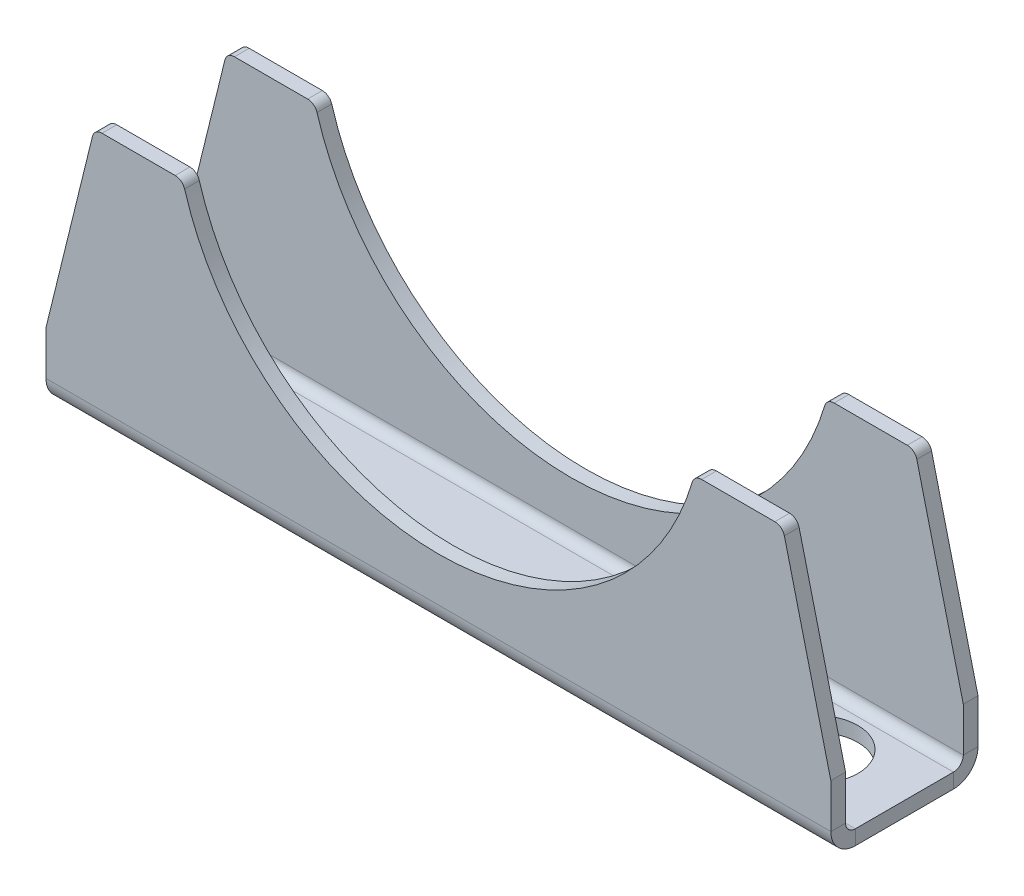
ISO-10303-21;
HEADER;
FILE_DESCRIPTION(('STEP AP214'),'2;1');
FILE_NAME('part.step','',(''),(''),'','','');
FILE_SCHEMA(('AUTOMOTIVE_DESIGN { 1 0 10303 214 1 1 1 1 }'));
ENDSEC;
DATA;
#1=APPLICATION_CONTEXT('core data for automotive mechanical design processes');
#2=APPLICATION_PROTOCOL_DEFINITION('international standard','automotive_design',2000,#1);
#3=PRODUCT_CONTEXT('',#1,'mechanical');
#4=PRODUCT('Part','Part','',(#3));
#5=PRODUCT_RELATED_PRODUCT_CATEGORY('part','',(#4));
#6=PRODUCT_DEFINITION_FORMATION('','',#4);
#7=PRODUCT_DEFINITION_CONTEXT('part definition',#1,'design');
#8=PRODUCT_DEFINITION('design','',#6,#7);
#9=PRODUCT_DEFINITION_SHAPE('','',#8);
#10=(LENGTH_UNIT() NAMED_UNIT(*) SI_UNIT(.MILLI.,.METRE.));
#11=(NAMED_UNIT(*) PLANE_ANGLE_UNIT() SI_UNIT($,.RADIAN.));
#12=(NAMED_UNIT(*) SI_UNIT($,.STERADIAN.) SOLID_ANGLE_UNIT());
#13=UNCERTAINTY_MEASURE_WITH_UNIT(LENGTH_MEASURE(1.E-05),#10,'distance_accuracy_value','');
#14=(GEOMETRIC_REPRESENTATION_CONTEXT(3) GLOBAL_UNCERTAINTY_ASSIGNED_CONTEXT((#13)) GLOBAL_UNIT_ASSIGNED_CONTEXT((#10,
#11,#12)) REPRESENTATION_CONTEXT('',''));
#15=CARTESIAN_POINT('',(0.,0.,0.));
#16=DIRECTION('',(0.,0.,1.));
#17=DIRECTION('',(1.,0.,0.));
#18=AXIS2_PLACEMENT_3D('',#15,#16,#17);
#19=CARTESIAN_POINT('',(80.,-1.5,-4.99999999999998));
#20=DIRECTION('',(1.,0.,0.));
#21=DIRECTION('',(0.,0.,-1.));
#22=AXIS2_PLACEMENT_3D('',#19,#20,#21);
#23=PLANE('',#22);
#24=DIRECTION('',(0.,1.,0.));
#25=VECTOR('',#24,1.);
#26=CARTESIAN_POINT('',(80.,1.00000000000001,-7.5));
#27=LINE('',#26,#25);
#28=CARTESIAN_POINT('',(80.,1.,-7.5));
#29=VERTEX_POINT('',#28);
#30=CARTESIAN_POINT('',(80.,5.49999999999998,-7.5));
#31=VERTEX_POINT('',#30);
#32=EDGE_CURVE('E281',#29,#31,#27,.T.);
#33=ORIENTED_EDGE('',*,*,#32,.T.);
#34=DIRECTION('',(0.,0.,1.));
#35=VECTOR('',#34,1.);
#36=CARTESIAN_POINT('',(80.,5.49999999999998,-27.5));
#37=LINE('',#36,#35);
#38=CARTESIAN_POINT('',(80.,5.49999999999998,-6.));
#39=VERTEX_POINT('',#38);
#40=EDGE_CURVE('E416',#31,#39,#37,.T.);
#41=ORIENTED_EDGE('',*,*,#40,.T.);
#42=DIRECTION('',(0.,1.,0.));
#43=VECTOR('',#42,1.);
#44=CARTESIAN_POINT('',(80.,1.00000000000001,-6.));
#45=LINE('',#44,#43);
#46=CARTESIAN_POINT('',(80.,1.,-6.));
#47=VERTEX_POINT('',#46);
#48=EDGE_CURVE('E449',#47,#39,#45,.T.);
#49=ORIENTED_EDGE('',*,*,#48,.F.);
#50=DIRECTION('',(0.,0.,-1.));
#51=VECTOR('',#50,1.);
#52=CARTESIAN_POINT('',(80.,1.,-6.));
#53=LINE('',#52,#51);
#54=EDGE_CURVE('E326',#47,#29,#53,.T.);
#55=ORIENTED_EDGE('',*,*,#54,.T.);
#56=EDGE_LOOP('',(#33,#41,#49,#55));
#57=FACE_BOUND('',#56,.T.);
#58=ADVANCED_FACE('F40',(#57),#23,.T.);
#59=CARTESIAN_POINT('',(80.,1.00000000000001,-7.5));
#60=DIRECTION('',(0.,0.,1.));
#61=DIRECTION('',(1.,0.,0.));
#62=AXIS2_PLACEMENT_3D('',#59,#60,#61);
#63=PLANE('',#62);
#64=DIRECTION('',(-1.,0.,0.));
#65=VECTOR('',#64,1.);
#66=CARTESIAN_POINT('',(80.,25.5,-7.5));
#67=LINE('',#66,#65);
#68=CARTESIAN_POINT('',(74.2931174471588,25.5,-7.5));
#69=VERTEX_POINT('',#68);
#70=CARTESIAN_POINT('',(66.8328157299975,25.5,-7.5));
#71=VERTEX_POINT('',#70);
#72=EDGE_CURVE('E320',#69,#71,#67,.T.);
#73=ORIENTED_EDGE('',*,*,#72,.F.);
#74=CARTESIAN_POINT('',(74.2931174471588,24.5,-7.5));
#75=DIRECTION('',(0.,0.,1.));
#76=DIRECTION('',(1.,0.,0.));
#77=AXIS2_PLACEMENT_3D('',#74,#75,#76);
#78=CIRCLE('',#77,1.);
#79=CARTESIAN_POINT('',(75.2641310476359,24.7390242407966,-7.5));
#80=VERTEX_POINT('',#79);
#81=EDGE_CURVE('E360',#69,#80,#78,.F.);
#82=ORIENTED_EDGE('',*,*,#81,.T.);
#83=DIRECTION('',(-0.239024240796562,0.971013600477165,0.));
#84=VECTOR('',#83,1.);
#85=CARTESIAN_POINT('',(81.0444310489573,1.25709664459768,-7.5));
#86=LINE('',#85,#84);
#87=EDGE_CURVE('E436',#31,#80,#86,.T.);
#88=ORIENTED_EDGE('',*,*,#87,.F.);
#89=ORIENTED_EDGE('',*,*,#32,.F.);
#90=DIRECTION('',(-1.,0.,0.));
#91=VECTOR('',#90,1.);
#92=CARTESIAN_POINT('',(80.,1.,-7.5));
#93=LINE('',#92,#91);
#94=CARTESIAN_POINT('',(0.,1.,-7.5));
#95=VERTEX_POINT('',#94);
#96=EDGE_CURVE('E282',#29,#95,#93,.T.);
#97=ORIENTED_EDGE('',*,*,#96,.T.);
#98=DIRECTION('',(0.,1.,0.));
#99=VECTOR('',#98,1.);
#100=CARTESIAN_POINT('',(0.,1.00000000000001,-7.5));
#101=LINE('',#100,#99);
#102=CARTESIAN_POINT('',(0.,5.5,-7.5));
#103=VERTEX_POINT('',#102);
#104=EDGE_CURVE('E255',#95,#103,#101,.T.);
#105=ORIENTED_EDGE('',*,*,#104,.T.);
#106=DIRECTION('',(0.239024240796562,0.971013600477165,0.));
#107=VECTOR('',#106,1.);
#108=CARTESIAN_POINT('',(3.5261759661125,19.8247597371729,-7.5));
#109=LINE('',#108,#107);
#110=CARTESIAN_POINT('',(4.73586895236409,24.7390242407966,-7.5));
#111=VERTEX_POINT('',#110);
#112=EDGE_CURVE('E232',#103,#111,#109,.T.);
#113=ORIENTED_EDGE('',*,*,#112,.T.);
#114=CARTESIAN_POINT('',(5.70688255284123,24.5,-7.5));
#115=DIRECTION('',(0.,0.,1.));
#116=DIRECTION('',(1.,0.,0.));
#117=AXIS2_PLACEMENT_3D('',#114,#115,#116);
#118=CIRCLE('',#117,1.);
#119=CARTESIAN_POINT('',(5.70688255284123,25.5,-7.5));
#120=VERTEX_POINT('',#119);
#121=EDGE_CURVE('E354',#111,#120,#118,.F.);
#122=ORIENTED_EDGE('',*,*,#121,.T.);
#123=CARTESIAN_POINT('',(13.1671842700025,25.5,-7.5));
#124=VERTEX_POINT('',#123);
#125=EDGE_CURVE('E317',#124,#120,#67,.T.);
#126=ORIENTED_EDGE('',*,*,#125,.F.);
#127=CARTESIAN_POINT('',(13.1671842700025,24.5,-7.5));
#128=DIRECTION('',(0.,0.,1.));
#129=DIRECTION('',(1.,0.,0.));
#130=AXIS2_PLACEMENT_3D('',#127,#128,#129);
#131=CIRCLE('',#130,1.);
#132=CARTESIAN_POINT('',(14.1254991175024,24.7857142857143,-7.5));
#133=VERTEX_POINT('',#132);
#134=EDGE_CURVE('E356',#124,#133,#131,.F.);
#135=ORIENTED_EDGE('',*,*,#134,.T.);
#136=CARTESIAN_POINT('',(40.,32.5,-7.5));
#137=DIRECTION('',(0.,0.,1.));
#138=DIRECTION('',(1.,0.,0.));
#139=AXIS2_PLACEMENT_3D('',#136,#137,#138);
#140=CIRCLE('',#139,27.);
#141=CARTESIAN_POINT('',(65.8745008824976,24.7857142857143,-7.5));
#142=VERTEX_POINT('',#141);
#143=EDGE_CURVE('E259',#133,#142,#140,.T.);
#144=ORIENTED_EDGE('',*,*,#143,.T.);
#145=CARTESIAN_POINT('',(66.8328157299975,24.5,-7.5));
#146=DIRECTION('',(0.,0.,1.));
#147=DIRECTION('',(1.,0.,0.));
#148=AXIS2_PLACEMENT_3D('',#145,#146,#147);
#149=CIRCLE('',#148,1.);
#150=EDGE_CURVE('E358',#142,#71,#149,.F.);
#151=ORIENTED_EDGE('',*,*,#150,.T.);
#152=EDGE_LOOP('',(#73,#82,#88,#89,#97,#105,#113,#122,#126,#135,#144,#151));
#153=FACE_BOUND('',#152,.T.);
#154=ADVANCED_FACE('F483',(#153),#63,.F.);
#155=CARTESIAN_POINT('',(80.,25.5,-6.));
#156=DIRECTION('',(0.,1.,0.));
#157=DIRECTION('',(0.,0.,1.));
#158=AXIS2_PLACEMENT_3D('',#155,#156,#157);
#159=PLANE('',#158);
#160=DIRECTION('',(-1.,0.,0.));
#161=VECTOR('',#160,1.);
#162=CARTESIAN_POINT('',(80.,25.5,-6.));
#163=LINE('',#162,#161);
#164=CARTESIAN_POINT('',(74.2931174471588,25.5,-6.));
#165=VERTEX_POINT('',#164);
#166=CARTESIAN_POINT('',(66.8328157299975,25.5,-6.));
#167=VERTEX_POINT('',#166);
#168=EDGE_CURVE('E316',#165,#167,#163,.T.);
#169=ORIENTED_EDGE('',*,*,#168,.F.);
#170=DIRECTION('',(0.,0.,1.));
#171=VECTOR('',#170,1.);
#172=CARTESIAN_POINT('',(74.2931174471588,25.5,-6.));
#173=LINE('',#172,#171);
#174=EDGE_CURVE('E352',#165,#69,#173,.F.);
#175=ORIENTED_EDGE('',*,*,#174,.T.);
#176=ORIENTED_EDGE('',*,*,#72,.T.);
#177=DIRECTION('',(0.,0.,-1.));
#178=VECTOR('',#177,1.);
#179=CARTESIAN_POINT('',(66.8328157299975,25.5,-6.));
#180=LINE('',#179,#178);
#181=EDGE_CURVE('E349',#71,#167,#180,.F.);
#182=ORIENTED_EDGE('',*,*,#181,.T.);
#183=EDGE_LOOP('',(#169,#175,#176,#182));
#184=FACE_BOUND('',#183,.T.);
#185=ADVANCED_FACE('F553',(#184),#159,.T.);
#186=CARTESIAN_POINT('',(13.1671842700025,25.5,-6.));
#187=VERTEX_POINT('',#186);
#188=CARTESIAN_POINT('',(5.70688255284123,25.5,-6.));
#189=VERTEX_POINT('',#188);
#190=EDGE_CURVE('E314',#187,#189,#163,.T.);
#191=ORIENTED_EDGE('',*,*,#190,.F.);
#192=DIRECTION('',(0.,0.,-1.));
#193=VECTOR('',#192,1.);
#194=CARTESIAN_POINT('',(13.1671842700025,25.5,-7.5));
#195=LINE('',#194,#193);
#196=EDGE_CURVE('E402',#187,#124,#195,.T.);
#197=ORIENTED_EDGE('',*,*,#196,.T.);
#198=ORIENTED_EDGE('',*,*,#125,.T.);
#199=DIRECTION('',(0.,0.,1.));
#200=VECTOR('',#199,1.);
#201=CARTESIAN_POINT('',(5.70688255284123,25.5,-6.));
#202=LINE('',#201,#200);
#203=EDGE_CURVE('E399',#120,#189,#202,.T.);
#204=ORIENTED_EDGE('',*,*,#203,.T.);
#205=EDGE_LOOP('',(#191,#197,#198,#204));
#206=FACE_BOUND('',#205,.T.);
#207=ADVANCED_FACE('F570',(#206),#159,.T.);
#208=CARTESIAN_POINT('',(80.,1.00000000000001,-6.));
#209=DIRECTION('',(0.,0.,1.));
#210=DIRECTION('',(1.,0.,0.));
#211=AXIS2_PLACEMENT_3D('',#208,#209,#210);
#212=PLANE('',#211);
#213=DIRECTION('',(-0.239024240796562,0.971013600477165,0.));
#214=VECTOR('',#213,1.);
#215=CARTESIAN_POINT('',(81.0444310489573,1.25709664459768,-6.));
#216=LINE('',#215,#214);
#217=CARTESIAN_POINT('',(75.2641310476359,24.7390242407966,-6.));
#218=VERTEX_POINT('',#217);
#219=EDGE_CURVE('E441',#39,#218,#216,.T.);
#220=ORIENTED_EDGE('',*,*,#219,.T.);
#221=CARTESIAN_POINT('',(74.2931174471588,24.5,-6.));
#222=DIRECTION('',(0.,0.,1.));
#223=DIRECTION('',(1.,0.,0.));
#224=AXIS2_PLACEMENT_3D('',#221,#222,#223);
#225=CIRCLE('',#224,1.);
#226=EDGE_CURVE('E347',#218,#165,#225,.T.);
#227=ORIENTED_EDGE('',*,*,#226,.T.);
#228=ORIENTED_EDGE('',*,*,#168,.T.);
#229=CARTESIAN_POINT('',(66.8328157299975,24.5,-6.));
#230=DIRECTION('',(0.,0.,1.));
#231=DIRECTION('',(1.,0.,0.));
#232=AXIS2_PLACEMENT_3D('',#229,#230,#231);
#233=CIRCLE('',#232,1.);
#234=CARTESIAN_POINT('',(65.8745008824976,24.7857142857143,-6.));
#235=VERTEX_POINT('',#234);
#236=EDGE_CURVE('E345',#167,#235,#233,.T.);
#237=ORIENTED_EDGE('',*,*,#236,.T.);
#238=CARTESIAN_POINT('',(40.,32.5,-6.));
#239=DIRECTION('',(0.,0.,1.));
#240=DIRECTION('',(1.,0.,0.));
#241=AXIS2_PLACEMENT_3D('',#238,#239,#240);
#242=CIRCLE('',#241,27.);
#243=CARTESIAN_POINT('',(14.1254991175024,24.7857142857143,-6.));
#244=VERTEX_POINT('',#243);
#245=EDGE_CURVE('E435',#244,#235,#242,.T.);
#246=ORIENTED_EDGE('',*,*,#245,.F.);
#247=CARTESIAN_POINT('',(13.1671842700025,24.5,-6.));
#248=DIRECTION('',(0.,0.,1.));
#249=DIRECTION('',(1.,0.,0.));
#250=AXIS2_PLACEMENT_3D('',#247,#248,#249);
#251=CIRCLE('',#250,1.);
#252=EDGE_CURVE('E343',#244,#187,#251,.T.);
#253=ORIENTED_EDGE('',*,*,#252,.T.);
#254=ORIENTED_EDGE('',*,*,#190,.T.);
#255=CARTESIAN_POINT('',(5.70688255284123,24.5,-6.));
#256=DIRECTION('',(0.,0.,1.));
#257=DIRECTION('',(1.,0.,0.));
#258=AXIS2_PLACEMENT_3D('',#255,#256,#257);
#259=CIRCLE('',#258,1.);
#260=CARTESIAN_POINT('',(4.73586895236409,24.7390242407966,-6.));
#261=VERTEX_POINT('',#260);
#262=EDGE_CURVE('E248',#189,#261,#259,.T.);
#263=ORIENTED_EDGE('',*,*,#262,.T.);
#264=DIRECTION('',(0.239024240796562,0.971013600477165,0.));
#265=VECTOR('',#264,1.);
#266=CARTESIAN_POINT('',(3.5261759661125,19.8247597371729,-6.));
#267=LINE('',#266,#265);
#268=CARTESIAN_POINT('',(0.,5.5,-6.));
#269=VERTEX_POINT('',#268);
#270=EDGE_CURVE('E229',#269,#261,#267,.T.);
#271=ORIENTED_EDGE('',*,*,#270,.F.);
#272=DIRECTION('',(0.,1.,0.));
#273=VECTOR('',#272,1.);
#274=CARTESIAN_POINT('',(0.,1.00000000000001,-6.));
#275=LINE('',#274,#273);
#276=CARTESIAN_POINT('',(0.,1.,-6.));
#277=VERTEX_POINT('',#276);
#278=EDGE_CURVE('E245',#277,#269,#275,.T.);
#279=ORIENTED_EDGE('',*,*,#278,.F.);
#280=DIRECTION('',(-1.,0.,0.));
#281=VECTOR('',#280,1.);
#282=CARTESIAN_POINT('',(80.,1.,-6.));
#283=LINE('',#282,#281);
#284=EDGE_CURVE('E312',#47,#277,#283,.T.);
#285=ORIENTED_EDGE('',*,*,#284,.F.);
#286=ORIENTED_EDGE('',*,*,#48,.T.);
#287=EDGE_LOOP('',(#220,#227,#228,#237,#246,#253,#254,#263,#271,#279,#285,#286));
#288=FACE_BOUND('',#287,.T.);
#289=ADVANCED_FACE('F243',(#288),#212,.T.);
#290=CARTESIAN_POINT('',(80.,25.5,6.));
#291=DIRECTION('',(0.,0.,-1.));
#292=DIRECTION('',(0.,1.,0.));
#293=AXIS2_PLACEMENT_3D('',#290,#291,#292);
#294=PLANE('',#293);
#295=DIRECTION('',(-1.,0.,0.));
#296=VECTOR('',#295,1.);
#297=CARTESIAN_POINT('',(80.,25.5,6.));
#298=LINE('',#297,#296);
#299=CARTESIAN_POINT('',(74.2931174471588,25.5,6.));
#300=VERTEX_POINT('',#299);
#301=CARTESIAN_POINT('',(66.8328157299975,25.5,6.));
#302=VERTEX_POINT('',#301);
#303=EDGE_CURVE('E302',#300,#302,#298,.T.);
#304=ORIENTED_EDGE('',*,*,#303,.F.);
#305=CARTESIAN_POINT('',(74.2931174471588,24.5,6.00000000000001));
#306=DIRECTION('',(0.,0.,-1.));
#307=DIRECTION('',(0.,1.,0.));
#308=AXIS2_PLACEMENT_3D('',#305,#306,#307);
#309=CIRCLE('',#308,1.);
#310=CARTESIAN_POINT('',(75.2641310476359,24.7390242407966,6.));
#311=VERTEX_POINT('',#310);
#312=EDGE_CURVE('E383',#300,#311,#309,.T.);
#313=ORIENTED_EDGE('',*,*,#312,.T.);
#314=DIRECTION('',(0.239024240796562,-0.971013600477165,0.));
#315=VECTOR('',#314,1.);
#316=CARTESIAN_POINT('',(75.3580842268562,24.3573482462325,6.));
#317=LINE('',#316,#315);
#318=CARTESIAN_POINT('',(80.,5.49999999999998,6.));
#319=VERTEX_POINT('',#318);
#320=EDGE_CURVE('E528',#311,#319,#317,.T.);
#321=ORIENTED_EDGE('',*,*,#320,.T.);
#322=DIRECTION('',(0.,-1.,0.));
#323=VECTOR('',#322,1.);
#324=CARTESIAN_POINT('',(80.,25.5,6.));
#325=LINE('',#324,#323);
#326=CARTESIAN_POINT('',(80.,1.00000000000001,6.));
#327=VERTEX_POINT('',#326);
#328=EDGE_CURVE('E461',#319,#327,#325,.T.);
#329=ORIENTED_EDGE('',*,*,#328,.T.);
#330=DIRECTION('',(-1.,0.,0.));
#331=VECTOR('',#330,1.);
#332=CARTESIAN_POINT('',(80.,1.00000000000001,6.));
#333=LINE('',#332,#331);
#334=CARTESIAN_POINT('',(0.,1.00000000000001,6.));
#335=VERTEX_POINT('',#334);
#336=EDGE_CURVE('E303',#327,#335,#333,.T.);
#337=ORIENTED_EDGE('',*,*,#336,.T.);
#338=DIRECTION('',(0.,-1.,0.));
#339=VECTOR('',#338,1.);
#340=CARTESIAN_POINT('',(0.,25.5,6.));
#341=LINE('',#340,#339);
#342=CARTESIAN_POINT('',(0.,5.5,6.00000000000001));
#343=VERTEX_POINT('',#342);
#344=EDGE_CURVE('E268',#343,#335,#341,.T.);
#345=ORIENTED_EDGE('',*,*,#344,.F.);
#346=DIRECTION('',(-0.239024240796562,-0.971013600477165,0.));
#347=VECTOR('',#346,1.);
#348=CARTESIAN_POINT('',(9.21252278821366,42.9250113388078,6.00000000000001));
#349=LINE('',#348,#347);
#350=CARTESIAN_POINT('',(4.73586895236408,24.7390242407966,6.));
#351=VERTEX_POINT('',#350);
#352=EDGE_CURVE('E249',#351,#343,#349,.T.);
#353=ORIENTED_EDGE('',*,*,#352,.F.);
#354=CARTESIAN_POINT('',(5.70688255284123,24.5,6.));
#355=DIRECTION('',(0.,0.,-1.));
#356=DIRECTION('',(0.,1.,0.));
#357=AXIS2_PLACEMENT_3D('',#354,#355,#356);
#358=CIRCLE('',#357,1.);
#359=CARTESIAN_POINT('',(5.70688255284123,25.5,6.));
#360=VERTEX_POINT('',#359);
#361=EDGE_CURVE('E378',#351,#360,#358,.T.);
#362=ORIENTED_EDGE('',*,*,#361,.T.);
#363=CARTESIAN_POINT('',(13.1671842700025,25.5,6.));
#364=VERTEX_POINT('',#363);
#365=EDGE_CURVE('E299',#364,#360,#298,.T.);
#366=ORIENTED_EDGE('',*,*,#365,.F.);
#367=CARTESIAN_POINT('',(13.1671842700025,24.5,6.00000000000001));
#368=DIRECTION('',(0.,0.,-1.));
#369=DIRECTION('',(0.,1.,0.));
#370=AXIS2_PLACEMENT_3D('',#367,#368,#369);
#371=CIRCLE('',#370,1.);
#372=CARTESIAN_POINT('',(14.1254991175024,24.7857142857143,6.));
#373=VERTEX_POINT('',#372);
#374=EDGE_CURVE('E55',#364,#373,#371,.T.);
#375=ORIENTED_EDGE('',*,*,#374,.T.);
#376=CARTESIAN_POINT('',(40.,32.5,6.00000000000001));
#377=DIRECTION('',(0.,0.,-1.));
#378=DIRECTION('',(0.,1.,0.));
#379=AXIS2_PLACEMENT_3D('',#376,#377,#378);
#380=CIRCLE('',#379,27.);
#381=CARTESIAN_POINT('',(65.8745008824976,24.7857142857143,6.));
#382=VERTEX_POINT('',#381);
#383=EDGE_CURVE('E433',#382,#373,#380,.T.);
#384=ORIENTED_EDGE('',*,*,#383,.F.);
#385=CARTESIAN_POINT('',(66.8328157299975,24.5,6.00000000000001));
#386=DIRECTION('',(0.,0.,-1.));
#387=DIRECTION('',(0.,1.,0.));
#388=AXIS2_PLACEMENT_3D('',#385,#386,#387);
#389=CIRCLE('',#388,1.);
#390=EDGE_CURVE('E381',#382,#302,#389,.T.);
#391=ORIENTED_EDGE('',*,*,#390,.T.);
#392=EDGE_LOOP('',(#304,#313,#321,#329,#337,#345,#353,#362,#366,#375,#384,#391));
#393=FACE_BOUND('',#392,.T.);
#394=ADVANCED_FACE('F415',(#393),#294,.T.);
#395=CARTESIAN_POINT('',(80.,25.5,7.5));
#396=DIRECTION('',(0.,1.,0.));
#397=DIRECTION('',(0.,0.,1.));
#398=AXIS2_PLACEMENT_3D('',#395,#396,#397);
#399=PLANE('',#398);
#400=DIRECTION('',(-1.,0.,0.));
#401=VECTOR('',#400,1.);
#402=CARTESIAN_POINT('',(80.,25.5,7.5));
#403=LINE('',#402,#401);
#404=CARTESIAN_POINT('',(74.2931174471588,25.5,7.5));
#405=VERTEX_POINT('',#404);
#406=CARTESIAN_POINT('',(66.8328157299975,25.5,7.5));
#407=VERTEX_POINT('',#406);
#408=EDGE_CURVE('E298',#405,#407,#403,.T.);
#409=ORIENTED_EDGE('',*,*,#408,.F.);
#410=DIRECTION('',(0.,0.,1.));
#411=VECTOR('',#410,1.);
#412=CARTESIAN_POINT('',(74.2931174471588,25.5,7.5));
#413=LINE('',#412,#411);
#414=EDGE_CURVE('E376',#405,#300,#413,.F.);
#415=ORIENTED_EDGE('',*,*,#414,.T.);
#416=ORIENTED_EDGE('',*,*,#303,.T.);
#417=DIRECTION('',(0.,0.,-1.));
#418=VECTOR('',#417,1.);
#419=CARTESIAN_POINT('',(66.8328157299975,25.5,7.5));
#420=LINE('',#419,#418);
#421=EDGE_CURVE('E373',#302,#407,#420,.F.);
#422=ORIENTED_EDGE('',*,*,#421,.T.);
#423=EDGE_LOOP('',(#409,#415,#416,#422));
#424=FACE_BOUND('',#423,.T.);
#425=ADVANCED_FACE('F696',(#424),#399,.T.);
#426=CARTESIAN_POINT('',(13.1671842700025,25.5,7.5));
#427=VERTEX_POINT('',#426);
#428=CARTESIAN_POINT('',(5.70688255284123,25.5,7.5));
#429=VERTEX_POINT('',#428);
#430=EDGE_CURVE('E295',#427,#429,#403,.T.);
#431=ORIENTED_EDGE('',*,*,#430,.F.);
#432=DIRECTION('',(0.,0.,-1.));
#433=VECTOR('',#432,1.);
#434=CARTESIAN_POINT('',(13.1671842700025,25.5,6.00000000000001));
#435=LINE('',#434,#433);
#436=EDGE_CURVE('E397',#427,#364,#435,.T.);
#437=ORIENTED_EDGE('',*,*,#436,.T.);
#438=ORIENTED_EDGE('',*,*,#365,.T.);
#439=DIRECTION('',(0.,0.,1.));
#440=VECTOR('',#439,1.);
#441=CARTESIAN_POINT('',(5.70688255284123,25.5,7.5));
#442=LINE('',#441,#440);
#443=EDGE_CURVE('E394',#360,#429,#442,.T.);
#444=ORIENTED_EDGE('',*,*,#443,.T.);
#445=EDGE_LOOP('',(#431,#437,#438,#444));
#446=FACE_BOUND('',#445,.T.);
#447=ADVANCED_FACE('F422',(#446),#399,.T.);
#448=CARTESIAN_POINT('',(80.,25.5,7.5));
#449=DIRECTION('',(0.,0.,-1.));
#450=DIRECTION('',(0.,1.,0.));
#451=AXIS2_PLACEMENT_3D('',#448,#449,#450);
#452=PLANE('',#451);
#453=DIRECTION('',(-0.239024240796562,0.971013600477165,0.));
#454=VECTOR('',#453,1.);
#455=CARTESIAN_POINT('',(76.7059198225447,18.8818923248613,7.5));
#456=LINE('',#455,#454);
#457=CARTESIAN_POINT('',(80.,5.49999999999998,7.5));
#458=VERTEX_POINT('',#457);
#459=CARTESIAN_POINT('',(75.2641310476359,24.7390242407966,7.5));
#460=VERTEX_POINT('',#459);
#461=EDGE_CURVE('E533',#458,#460,#456,.T.);
#462=ORIENTED_EDGE('',*,*,#461,.T.);
#463=CARTESIAN_POINT('',(74.2931174471588,24.5,7.50000000000001));
#464=DIRECTION('',(0.,0.,-1.));
#465=DIRECTION('',(0.,1.,0.));
#466=AXIS2_PLACEMENT_3D('',#463,#464,#465);
#467=CIRCLE('',#466,1.);
#468=EDGE_CURVE('E371',#460,#405,#467,.F.);
#469=ORIENTED_EDGE('',*,*,#468,.T.);
#470=ORIENTED_EDGE('',*,*,#408,.T.);
#471=CARTESIAN_POINT('',(66.8328157299975,24.5,7.50000000000001));
#472=DIRECTION('',(0.,0.,-1.));
#473=DIRECTION('',(0.,1.,0.));
#474=AXIS2_PLACEMENT_3D('',#471,#472,#473);
#475=CIRCLE('',#474,1.);
#476=CARTESIAN_POINT('',(65.8745008824976,24.7857142857143,7.5));
#477=VERTEX_POINT('',#476);
#478=EDGE_CURVE('E369',#407,#477,#475,.F.);
#479=ORIENTED_EDGE('',*,*,#478,.T.);
#480=CARTESIAN_POINT('',(40.,32.5,7.5));
#481=DIRECTION('',(0.,0.,1.));
#482=DIRECTION('',(1.,0.,0.));
#483=AXIS2_PLACEMENT_3D('',#480,#481,#482);
#484=CIRCLE('',#483,27.);
#485=CARTESIAN_POINT('',(14.1254991175024,24.7857142857143,7.5));
#486=VERTEX_POINT('',#485);
#487=EDGE_CURVE('E428',#486,#477,#484,.T.);
#488=ORIENTED_EDGE('',*,*,#487,.F.);
#489=CARTESIAN_POINT('',(13.1671842700025,24.5,7.50000000000001));
#490=DIRECTION('',(0.,0.,-1.));
#491=DIRECTION('',(0.,1.,0.));
#492=AXIS2_PLACEMENT_3D('',#489,#490,#491);
#493=CIRCLE('',#492,1.);
#494=EDGE_CURVE('E367',#486,#427,#493,.F.);
#495=ORIENTED_EDGE('',*,*,#494,.T.);
#496=ORIENTED_EDGE('',*,*,#430,.T.);
#497=CARTESIAN_POINT('',(5.70688255284123,24.5,7.5));
#498=DIRECTION('',(0.,0.,-1.));
#499=DIRECTION('',(0.,1.,0.));
#500=AXIS2_PLACEMENT_3D('',#497,#498,#499);
#501=CIRCLE('',#500,1.);
#502=CARTESIAN_POINT('',(4.73586895236407,24.7390242407966,7.5));
#503=VERTEX_POINT('',#502);
#504=EDGE_CURVE('E365',#429,#503,#501,.F.);
#505=ORIENTED_EDGE('',*,*,#504,.T.);
#506=DIRECTION('',(0.239024240796562,0.971013600477165,0.));
#507=VECTOR('',#506,1.);
#508=CARTESIAN_POINT('',(-1.27652683761455,0.314229232286052,7.5));
#509=LINE('',#508,#507);
#510=CARTESIAN_POINT('',(0.,5.49999999999995,7.5));
#511=VERTEX_POINT('',#510);
#512=EDGE_CURVE('E410',#511,#503,#509,.T.);
#513=ORIENTED_EDGE('',*,*,#512,.F.);
#514=DIRECTION('',(0.,-1.,0.));
#515=VECTOR('',#514,1.);
#516=CARTESIAN_POINT('',(0.,25.5,7.5));
#517=LINE('',#516,#515);
#518=CARTESIAN_POINT('',(0.,1.00000000000002,7.5));
#519=VERTEX_POINT('',#518);
#520=EDGE_CURVE('E270',#511,#519,#517,.T.);
#521=ORIENTED_EDGE('',*,*,#520,.T.);
#522=DIRECTION('',(-1.,0.,0.));
#523=VECTOR('',#522,1.);
#524=CARTESIAN_POINT('',(80.,1.00000000000002,7.5));
#525=LINE('',#524,#523);
#526=CARTESIAN_POINT('',(80.,1.00000000000002,7.5));
#527=VERTEX_POINT('',#526);
#528=EDGE_CURVE('E292',#527,#519,#525,.T.);
#529=ORIENTED_EDGE('',*,*,#528,.F.);
#530=DIRECTION('',(0.,-1.,0.));
#531=VECTOR('',#530,1.);
#532=CARTESIAN_POINT('',(80.,25.5,7.5));
#533=LINE('',#532,#531);
#534=EDGE_CURVE('E463',#458,#527,#533,.T.);
#535=ORIENTED_EDGE('',*,*,#534,.F.);
#536=EDGE_LOOP('',(#462,#469,#470,#479,#488,#495,#496,#505,#513,#521,#529,#535));
#537=FACE_BOUND('',#536,.T.);
#538=ADVANCED_FACE('F426',(#537),#452,.F.);
#539=CARTESIAN_POINT('',(80.,1.,-5.));
#540=DIRECTION('',(1.,0.,0.));
#541=DIRECTION('',(0.,0.,-1.));
#542=AXIS2_PLACEMENT_3D('',#539,#540,#541);
#543=PLANE('',#542);
#544=ORIENTED_EDGE('',*,*,#328,.F.);
#545=DIRECTION('',(0.,0.,1.));
#546=VECTOR('',#545,1.);
#547=CARTESIAN_POINT('',(80.,5.49999999999995,-5.));
#548=LINE('',#547,#546);
#549=EDGE_CURVE('E237',#319,#458,#548,.T.);
#550=ORIENTED_EDGE('',*,*,#549,.T.);
#551=ORIENTED_EDGE('',*,*,#534,.T.);
#552=DIRECTION('',(0.,0.,-1.));
#553=VECTOR('',#552,1.);
#554=CARTESIAN_POINT('',(80.,1.00000000000002,7.5));
#555=LINE('',#554,#553);
#556=EDGE_CURVE('E333',#527,#327,#555,.T.);
#557=ORIENTED_EDGE('',*,*,#556,.T.);
#558=EDGE_LOOP('',(#544,#550,#551,#557));
#559=FACE_BOUND('',#558,.T.);
#560=ADVANCED_FACE('F531',(#559),#543,.T.);
#561=CARTESIAN_POINT('',(80.,0.,4.99999999999999));
#562=DIRECTION('',(1.,0.,0.));
#563=DIRECTION('',(0.,0.,-1.));
#564=AXIS2_PLACEMENT_3D('',#561,#562,#563);
#565=PLANE('',#564);
#566=DIRECTION('',(0.,-1.,0.));
#567=VECTOR('',#566,1.);
#568=CARTESIAN_POINT('',(80.,0.,4.99999999999999));
#569=LINE('',#568,#567);
#570=CARTESIAN_POINT('',(80.,0.,4.99999999999999));
#571=VERTEX_POINT('',#570);
#572=CARTESIAN_POINT('',(80.,-1.5,4.99999999999999));
#573=VERTEX_POINT('',#572);
#574=EDGE_CURVE('E238',#571,#573,#569,.T.);
#575=ORIENTED_EDGE('',*,*,#574,.F.);
#576=CARTESIAN_POINT('',(80.,1.,5.));
#577=DIRECTION('',(1.,0.,0.));
#578=DIRECTION('',(0.,0.,-1.));
#579=AXIS2_PLACEMENT_3D('',#576,#577,#578);
#580=CIRCLE('',#579,1.);
#581=EDGE_CURVE('E458',#327,#571,#580,.T.);
#582=ORIENTED_EDGE('',*,*,#581,.F.);
#583=ORIENTED_EDGE('',*,*,#556,.F.);
#584=CARTESIAN_POINT('',(80.,1.,5.));
#585=DIRECTION('',(1.,0.,0.));
#586=DIRECTION('',(0.,0.,-1.));
#587=AXIS2_PLACEMENT_3D('',#584,#585,#586);
#588=CIRCLE('',#587,2.5);
#589=EDGE_CURVE('E465',#527,#573,#588,.T.);
#590=ORIENTED_EDGE('',*,*,#589,.T.);
#591=EDGE_LOOP('',(#575,#582,#583,#590));
#592=FACE_BOUND('',#591,.T.);
#593=ADVANCED_FACE('F505',(#592),#565,.T.);
#594=CARTESIAN_POINT('',(80.,1.00000000000002,7.5));
#595=DIRECTION('',(1.,0.,0.));
#596=DIRECTION('',(0.,0.,-1.));
#597=AXIS2_PLACEMENT_3D('',#594,#595,#596);
#598=PLANE('',#597);
#599=DIRECTION('',(0.,0.,-1.));
#600=VECTOR('',#599,1.);
#601=CARTESIAN_POINT('',(80.,0.,4.99999999999999));
#602=LINE('',#601,#600);
#603=CARTESIAN_POINT('',(80.,0.,-4.99999999999999));
#604=VERTEX_POINT('',#603);
#605=EDGE_CURVE('E455',#571,#604,#602,.T.);
#606=ORIENTED_EDGE('',*,*,#605,.F.);
#607=ORIENTED_EDGE('',*,*,#574,.T.);
#608=DIRECTION('',(0.,0.,-1.));
#609=VECTOR('',#608,1.);
#610=CARTESIAN_POINT('',(80.,-1.5,4.99999999999999));
#611=LINE('',#610,#609);
#612=CARTESIAN_POINT('',(80.,-1.5,-4.99999999999998));
#613=VERTEX_POINT('',#612);
#614=EDGE_CURVE('E468',#573,#613,#611,.T.);
#615=ORIENTED_EDGE('',*,*,#614,.T.);
#616=DIRECTION('',(0.,1.,0.));
#617=VECTOR('',#616,1.);
#618=CARTESIAN_POINT('',(80.,-1.5,-4.99999999999998));
#619=LINE('',#618,#617);
#620=EDGE_CURVE('E324',#613,#604,#619,.T.);
#621=ORIENTED_EDGE('',*,*,#620,.T.);
#622=EDGE_LOOP('',(#606,#607,#615,#621));
#623=FACE_BOUND('',#622,.T.);
#624=ADVANCED_FACE('F497',(#623),#598,.T.);
#625=CARTESIAN_POINT('',(0.,1.00000000000001,6.));
#626=DIRECTION('',(-1.,0.,0.));
#627=DIRECTION('',(0.,0.,1.));
#628=AXIS2_PLACEMENT_3D('',#625,#626,#627);
#629=PLANE('',#628);
#630=DIRECTION('',(0.,0.,1.));
#631=VECTOR('',#630,1.);
#632=CARTESIAN_POINT('',(0.,1.00000000000001,6.));
#633=LINE('',#632,#631);
#634=EDGE_CURVE('E330',#335,#519,#633,.T.);
#635=ORIENTED_EDGE('',*,*,#634,.F.);
#636=CARTESIAN_POINT('',(0.,1.,5.));
#637=DIRECTION('',(1.,0.,0.));
#638=DIRECTION('',(0.,0.,-1.));
#639=AXIS2_PLACEMENT_3D('',#636,#637,#638);
#640=CIRCLE('',#639,1.);
#641=CARTESIAN_POINT('',(0.,0.,4.99999999999999));
#642=VERTEX_POINT('',#641);
#643=EDGE_CURVE('E265',#335,#642,#640,.T.);
#644=ORIENTED_EDGE('',*,*,#643,.T.);
#645=DIRECTION('',(0.,1.,0.));
#646=VECTOR('',#645,1.);
#647=CARTESIAN_POINT('',(0.,-1.5,4.99999999999999));
#648=LINE('',#647,#646);
#649=CARTESIAN_POINT('',(0.,-1.5,4.99999999999999));
#650=VERTEX_POINT('',#649);
#651=EDGE_CURVE('E328',#650,#642,#648,.T.);
#652=ORIENTED_EDGE('',*,*,#651,.F.);
#653=CARTESIAN_POINT('',(0.,1.,5.));
#654=DIRECTION('',(1.,0.,0.));
#655=DIRECTION('',(0.,0.,-1.));
#656=AXIS2_PLACEMENT_3D('',#653,#654,#655);
#657=CIRCLE('',#656,2.5);
#658=EDGE_CURVE('E272',#519,#650,#657,.T.);
#659=ORIENTED_EDGE('',*,*,#658,.F.);
#660=EDGE_LOOP('',(#635,#644,#652,#659));
#661=FACE_BOUND('',#660,.T.);
#662=ADVANCED_FACE('F523',(#661),#629,.T.);
#663=CARTESIAN_POINT('',(0.,-1.5,4.99999999999999));
#664=DIRECTION('',(-1.,0.,0.));
#665=DIRECTION('',(0.,0.,1.));
#666=AXIS2_PLACEMENT_3D('',#663,#664,#665);
#667=PLANE('',#666);
#668=DIRECTION('',(0.,0.,1.));
#669=VECTOR('',#668,1.);
#670=CARTESIAN_POINT('',(0.,5.5,-27.5));
#671=LINE('',#670,#669);
#672=EDGE_CURVE('E535',#343,#511,#671,.T.);
#673=ORIENTED_EDGE('',*,*,#672,.F.);
#674=ORIENTED_EDGE('',*,*,#344,.T.);
#675=ORIENTED_EDGE('',*,*,#634,.T.);
#676=ORIENTED_EDGE('',*,*,#520,.F.);
#677=EDGE_LOOP('',(#673,#674,#675,#676));
#678=FACE_BOUND('',#677,.T.);
#679=ADVANCED_FACE('F534',(#678),#667,.T.);
#680=CARTESIAN_POINT('',(80.,1.,-6.));
#681=DIRECTION('',(1.,0.,0.));
#682=DIRECTION('',(0.,0.,-1.));
#683=AXIS2_PLACEMENT_3D('',#680,#681,#682);
#684=PLANE('',#683);
#685=ORIENTED_EDGE('',*,*,#54,.F.);
#686=CARTESIAN_POINT('',(80.,1.,-5.));
#687=DIRECTION('',(1.,0.,0.));
#688=DIRECTION('',(0.,0.,-1.));
#689=AXIS2_PLACEMENT_3D('',#686,#687,#688);
#690=CIRCLE('',#689,1.);
#691=EDGE_CURVE('E452',#604,#47,#690,.T.);
#692=ORIENTED_EDGE('',*,*,#691,.F.);
#693=ORIENTED_EDGE('',*,*,#620,.F.);
#694=CARTESIAN_POINT('',(80.,1.,-5.));
#695=DIRECTION('',(1.,0.,0.));
#696=DIRECTION('',(0.,0.,-1.));
#697=AXIS2_PLACEMENT_3D('',#694,#695,#696);
#698=CIRCLE('',#697,2.5);
#699=EDGE_CURVE('E286',#613,#29,#698,.T.);
#700=ORIENTED_EDGE('',*,*,#699,.T.);
#701=EDGE_LOOP('',(#685,#692,#693,#700));
#702=FACE_BOUND('',#701,.T.);
#703=ADVANCED_FACE('F474',(#702),#684,.T.);
#704=CARTESIAN_POINT('',(0.,0.,-4.99999999999999));
#705=DIRECTION('',(-1.,0.,0.));
#706=DIRECTION('',(0.,0.,1.));
#707=AXIS2_PLACEMENT_3D('',#704,#705,#706);
#708=PLANE('',#707);
#709=DIRECTION('',(0.,-1.,0.));
#710=VECTOR('',#709,1.);
#711=CARTESIAN_POINT('',(0.,0.,-4.99999999999999));
#712=LINE('',#711,#710);
#713=CARTESIAN_POINT('',(0.,0.,-4.99999999999999));
#714=VERTEX_POINT('',#713);
#715=CARTESIAN_POINT('',(0.,-1.5,-4.99999999999998));
#716=VERTEX_POINT('',#715);
#717=EDGE_CURVE('E322',#714,#716,#712,.T.);
#718=ORIENTED_EDGE('',*,*,#717,.F.);
#719=CARTESIAN_POINT('',(0.,1.,-5.));
#720=DIRECTION('',(1.,0.,0.));
#721=DIRECTION('',(0.,0.,-1.));
#722=AXIS2_PLACEMENT_3D('',#719,#720,#721);
#723=CIRCLE('',#722,1.);
#724=EDGE_CURVE('E254',#714,#277,#723,.T.);
#725=ORIENTED_EDGE('',*,*,#724,.T.);
#726=DIRECTION('',(0.,0.,1.));
#727=VECTOR('',#726,1.);
#728=CARTESIAN_POINT('',(0.,1.,-7.5));
#729=LINE('',#728,#727);
#730=EDGE_CURVE('E252',#95,#277,#729,.T.);
#731=ORIENTED_EDGE('',*,*,#730,.F.);
#732=CARTESIAN_POINT('',(0.,1.,-5.));
#733=DIRECTION('',(1.,0.,0.));
#734=DIRECTION('',(0.,0.,-1.));
#735=AXIS2_PLACEMENT_3D('',#732,#733,#734);
#736=CIRCLE('',#735,2.5);
#737=EDGE_CURVE('E278',#716,#95,#736,.T.);
#738=ORIENTED_EDGE('',*,*,#737,.F.);
#739=EDGE_LOOP('',(#718,#725,#731,#738));
#740=FACE_BOUND('',#739,.T.);
#741=ADVANCED_FACE('F518',(#740),#708,.T.);
#742=CARTESIAN_POINT('',(0.,1.,-7.5));
#743=DIRECTION('',(-1.,0.,0.));
#744=DIRECTION('',(0.,0.,1.));
#745=AXIS2_PLACEMENT_3D('',#742,#743,#744);
#746=PLANE('',#745);
#747=DIRECTION('',(0.,0.,-1.));
#748=VECTOR('',#747,1.);
#749=CARTESIAN_POINT('',(0.,0.,4.99999999999999));
#750=LINE('',#749,#748);
#751=EDGE_CURVE('E257',#642,#714,#750,.T.);
#752=ORIENTED_EDGE('',*,*,#751,.T.);
#753=ORIENTED_EDGE('',*,*,#717,.T.);
#754=DIRECTION('',(0.,0.,-1.));
#755=VECTOR('',#754,1.);
#756=CARTESIAN_POINT('',(0.,-1.5,4.99999999999999));
#757=LINE('',#756,#755);
#758=EDGE_CURVE('E275',#650,#716,#757,.T.);
#759=ORIENTED_EDGE('',*,*,#758,.F.);
#760=ORIENTED_EDGE('',*,*,#651,.T.);
#761=EDGE_LOOP('',(#752,#753,#759,#760));
#762=FACE_BOUND('',#761,.T.);
#763=ADVANCED_FACE('F520',(#762),#746,.T.);
#764=CARTESIAN_POINT('',(80.,1.,-5.));
#765=DIRECTION('',(-1.,0.,0.));
#766=DIRECTION('',(0.,0.,1.));
#767=AXIS2_PLACEMENT_3D('',#764,#765,#766);
#768=CYLINDRICAL_SURFACE('',#767,1.);
#769=ORIENTED_EDGE('',*,*,#724,.F.);
#770=DIRECTION('',(-1.,0.,0.));
#771=VECTOR('',#770,1.);
#772=CARTESIAN_POINT('',(80.,0.,-4.99999999999999));
#773=LINE('',#772,#771);
#774=EDGE_CURVE('E309',#604,#714,#773,.T.);
#775=ORIENTED_EDGE('',*,*,#774,.F.);
#776=ORIENTED_EDGE('',*,*,#691,.T.);
#777=ORIENTED_EDGE('',*,*,#284,.T.);
#778=EDGE_LOOP('',(#769,#775,#776,#777));
#779=FACE_BOUND('',#778,.T.);
#780=ADVANCED_FACE('F490',(#779),#768,.F.);
#781=CARTESIAN_POINT('',(80.,0.,4.99999999999999));
#782=DIRECTION('',(0.,1.,0.));
#783=DIRECTION('',(0.,0.,1.));
#784=AXIS2_PLACEMENT_3D('',#781,#782,#783);
#785=PLANE('',#784);
#786=CARTESIAN_POINT('',(9.,0.,0.));
#787=DIRECTION('',(0.,1.,0.));
#788=DIRECTION('',(0.,0.,1.));
#789=AXIS2_PLACEMENT_3D('',#786,#787,#788);
#790=CIRCLE('',#789,4.25);
#791=CARTESIAN_POINT('',(9.,0.,4.25));
#792=VERTEX_POINT('',#791);
#793=EDGE_CURVE('E538',#792,#792,#790,.T.);
#794=ORIENTED_EDGE('',*,*,#793,.F.);
#795=EDGE_LOOP('',(#794));
#796=FACE_BOUND('',#795,.T.);
#797=CARTESIAN_POINT('',(71.,0.,0.));
#798=DIRECTION('',(0.,1.,0.));
#799=DIRECTION('',(0.,0.,1.));
#800=AXIS2_PLACEMENT_3D('',#797,#798,#799);
#801=CIRCLE('',#800,4.25000000000001);
#802=CARTESIAN_POINT('',(71.,0.,4.25000000000001));
#803=VERTEX_POINT('',#802);
#804=EDGE_CURVE('E975',#803,#803,#801,.T.);
#805=ORIENTED_EDGE('',*,*,#804,.F.);
#806=EDGE_LOOP('',(#805));
#807=FACE_BOUND('',#806,.T.);
#808=ORIENTED_EDGE('',*,*,#751,.F.);
#809=DIRECTION('',(-1.,0.,0.));
#810=VECTOR('',#809,1.);
#811=CARTESIAN_POINT('',(80.,0.,4.99999999999999));
#812=LINE('',#811,#810);
#813=EDGE_CURVE('E306',#571,#642,#812,.T.);
#814=ORIENTED_EDGE('',*,*,#813,.F.);
#815=ORIENTED_EDGE('',*,*,#605,.T.);
#816=ORIENTED_EDGE('',*,*,#774,.T.);
#817=EDGE_LOOP('',(#808,#814,#815,#816));
#818=FACE_BOUND('',#817,.T.);
#819=ADVANCED_FACE('F495',(#796,#807,#818),#785,.T.);
#820=CARTESIAN_POINT('',(80.,1.,5.));
#821=DIRECTION('',(-1.,0.,0.));
#822=DIRECTION('',(0.,0.,1.));
#823=AXIS2_PLACEMENT_3D('',#820,#821,#822);
#824=CYLINDRICAL_SURFACE('',#823,1.);
#825=ORIENTED_EDGE('',*,*,#643,.F.);
#826=ORIENTED_EDGE('',*,*,#336,.F.);
#827=ORIENTED_EDGE('',*,*,#581,.T.);
#828=ORIENTED_EDGE('',*,*,#813,.T.);
#829=EDGE_LOOP('',(#825,#826,#827,#828));
#830=FACE_BOUND('',#829,.T.);
#831=ADVANCED_FACE('F502',(#830),#824,.F.);
#832=CARTESIAN_POINT('',(80.,1.,5.));
#833=DIRECTION('',(-1.,0.,0.));
#834=DIRECTION('',(0.,0.,1.));
#835=AXIS2_PLACEMENT_3D('',#832,#833,#834);
#836=CYLINDRICAL_SURFACE('',#835,2.5);
#837=ORIENTED_EDGE('',*,*,#658,.T.);
#838=DIRECTION('',(-1.,0.,0.));
#839=VECTOR('',#838,1.);
#840=CARTESIAN_POINT('',(80.,-1.5,4.99999999999999));
#841=LINE('',#840,#839);
#842=EDGE_CURVE('E289',#573,#650,#841,.T.);
#843=ORIENTED_EDGE('',*,*,#842,.F.);
#844=ORIENTED_EDGE('',*,*,#589,.F.);
#845=ORIENTED_EDGE('',*,*,#528,.T.);
#846=EDGE_LOOP('',(#837,#843,#844,#845));
#847=FACE_BOUND('',#846,.T.);
#848=ADVANCED_FACE('F511',(#847),#836,.T.);
#849=CARTESIAN_POINT('',(80.,-1.5,4.99999999999999));
#850=DIRECTION('',(0.,1.,0.));
#851=DIRECTION('',(0.,0.,1.));
#852=AXIS2_PLACEMENT_3D('',#849,#850,#851);
#853=PLANE('',#852);
#854=CARTESIAN_POINT('',(9.,-1.5,0.));
#855=DIRECTION('',(0.,-1.,0.));
#856=DIRECTION('',(0.,0.,-1.));
#857=AXIS2_PLACEMENT_3D('',#854,#855,#856);
#858=CIRCLE('',#857,4.25);
#859=CARTESIAN_POINT('',(9.,-1.5,-4.25));
#860=VERTEX_POINT('',#859);
#861=EDGE_CURVE('E978',#860,#860,#858,.T.);
#862=ORIENTED_EDGE('',*,*,#861,.F.);
#863=EDGE_LOOP('',(#862));
#864=FACE_BOUND('',#863,.T.);
#865=CARTESIAN_POINT('',(71.,-1.5,0.));
#866=DIRECTION('',(0.,-1.,0.));
#867=DIRECTION('',(0.,0.,-1.));
#868=AXIS2_PLACEMENT_3D('',#865,#866,#867);
#869=CIRCLE('',#868,4.25000000000001);
#870=CARTESIAN_POINT('',(71.,-1.5,-4.25000000000001));
#871=VERTEX_POINT('',#870);
#872=EDGE_CURVE('E979',#871,#871,#869,.T.);
#873=ORIENTED_EDGE('',*,*,#872,.F.);
#874=EDGE_LOOP('',(#873));
#875=FACE_BOUND('',#874,.T.);
#876=ORIENTED_EDGE('',*,*,#758,.T.);
#877=DIRECTION('',(-1.,0.,0.));
#878=VECTOR('',#877,1.);
#879=CARTESIAN_POINT('',(80.,-1.5,-4.99999999999998));
#880=LINE('',#879,#878);
#881=EDGE_CURVE('E285',#613,#716,#880,.T.);
#882=ORIENTED_EDGE('',*,*,#881,.F.);
#883=ORIENTED_EDGE('',*,*,#614,.F.);
#884=ORIENTED_EDGE('',*,*,#842,.T.);
#885=EDGE_LOOP('',(#876,#882,#883,#884));
#886=FACE_BOUND('',#885,.T.);
#887=ADVANCED_FACE('F516',(#864,#875,#886),#853,.F.);
#888=CARTESIAN_POINT('',(80.,1.,-5.));
#889=DIRECTION('',(-1.,0.,0.));
#890=DIRECTION('',(0.,0.,1.));
#891=AXIS2_PLACEMENT_3D('',#888,#889,#890);
#892=CYLINDRICAL_SURFACE('',#891,2.5);
#893=ORIENTED_EDGE('',*,*,#737,.T.);
#894=ORIENTED_EDGE('',*,*,#96,.F.);
#895=ORIENTED_EDGE('',*,*,#699,.F.);
#896=ORIENTED_EDGE('',*,*,#881,.T.);
#897=EDGE_LOOP('',(#893,#894,#895,#896));
#898=FACE_BOUND('',#897,.T.);
#899=ADVANCED_FACE('F478',(#898),#892,.T.);
#900=CARTESIAN_POINT('',(0.,1.,-5.));
#901=DIRECTION('',(1.,0.,0.));
#902=DIRECTION('',(0.,0.,-1.));
#903=AXIS2_PLACEMENT_3D('',#900,#901,#902);
#904=PLANE('',#903);
#905=ORIENTED_EDGE('',*,*,#278,.T.);
#906=DIRECTION('',(0.,0.,-1.));
#907=VECTOR('',#906,1.);
#908=CARTESIAN_POINT('',(0.,5.5,-5.));
#909=LINE('',#908,#907);
#910=EDGE_CURVE('E226',#269,#103,#909,.T.);
#911=ORIENTED_EDGE('',*,*,#910,.T.);
#912=ORIENTED_EDGE('',*,*,#104,.F.);
#913=ORIENTED_EDGE('',*,*,#730,.T.);
#914=EDGE_LOOP('',(#905,#911,#912,#913));
#915=FACE_BOUND('',#914,.T.);
#916=ADVANCED_FACE('F251',(#915),#904,.F.);
#917=CARTESIAN_POINT('',(-1.27652683761455,0.314229232286052,-27.5));
#918=DIRECTION('',(0.971013600477165,-0.239024240796562,0.));
#919=DIRECTION('',(0.239024240796562,0.971013600477165,0.));
#920=AXIS2_PLACEMENT_3D('',#917,#918,#919);
#921=PLANE('',#920);
#922=ORIENTED_EDGE('',*,*,#270,.T.);
#923=DIRECTION('',(0.,0.,1.));
#924=VECTOR('',#923,1.);
#925=CARTESIAN_POINT('',(4.73586895236407,24.7390242407966,-7.5));
#926=LINE('',#925,#924);
#927=EDGE_CURVE('E11',#261,#111,#926,.F.);
#928=ORIENTED_EDGE('',*,*,#927,.T.);
#929=ORIENTED_EDGE('',*,*,#112,.F.);
#930=ORIENTED_EDGE('',*,*,#910,.F.);
#931=EDGE_LOOP('',(#922,#928,#929,#930));
#932=FACE_BOUND('',#931,.T.);
#933=ADVANCED_FACE('F228',(#932),#921,.F.);
#934=CARTESIAN_POINT('',(76.7059198225447,18.8818923248613,-27.5));
#935=DIRECTION('',(0.971013600477165,0.239024240796562,0.));
#936=DIRECTION('',(-0.239024240796562,0.971013600477165,0.));
#937=AXIS2_PLACEMENT_3D('',#934,#935,#936);
#938=PLANE('',#937);
#939=ORIENTED_EDGE('',*,*,#320,.F.);
#940=DIRECTION('',(0.,0.,1.));
#941=VECTOR('',#940,1.);
#942=CARTESIAN_POINT('',(75.2641310476359,24.7390242407966,-27.5));
#943=LINE('',#942,#941);
#944=EDGE_CURVE('E362',#311,#460,#943,.T.);
#945=ORIENTED_EDGE('',*,*,#944,.T.);
#946=ORIENTED_EDGE('',*,*,#461,.F.);
#947=ORIENTED_EDGE('',*,*,#549,.F.);
#948=EDGE_LOOP('',(#939,#945,#946,#947));
#949=FACE_BOUND('',#948,.T.);
#950=ADVANCED_FACE('F680',(#949),#938,.T.);
#951=ORIENTED_EDGE('',*,*,#512,.T.);
#952=DIRECTION('',(0.,0.,1.));
#953=VECTOR('',#952,1.);
#954=CARTESIAN_POINT('',(4.73586895236407,24.7390242407966,6.00000000000001));
#955=LINE('',#954,#953);
#956=EDGE_CURVE('E48',#503,#351,#955,.F.);
#957=ORIENTED_EDGE('',*,*,#956,.T.);
#958=ORIENTED_EDGE('',*,*,#352,.T.);
#959=ORIENTED_EDGE('',*,*,#672,.T.);
#960=EDGE_LOOP('',(#951,#957,#958,#959));
#961=FACE_BOUND('',#960,.T.);
#962=ADVANCED_FACE('F407',(#961),#921,.F.);
#963=CARTESIAN_POINT('',(40.,32.5,-27.5));
#964=DIRECTION('',(0.,0.,1.));
#965=DIRECTION('',(1.,0.,0.));
#966=AXIS2_PLACEMENT_3D('',#963,#964,#965);
#967=CYLINDRICAL_SURFACE('',#966,27.);
#968=ORIENTED_EDGE('',*,*,#487,.T.);
#969=DIRECTION('',(0.,0.,1.));
#970=VECTOR('',#969,1.);
#971=CARTESIAN_POINT('',(65.8745008824976,24.7857142857143,-27.5));
#972=LINE('',#971,#970);
#973=EDGE_CURVE('E62',#477,#382,#972,.F.);
#974=ORIENTED_EDGE('',*,*,#973,.T.);
#975=ORIENTED_EDGE('',*,*,#383,.T.);
#976=DIRECTION('',(0.,0.,1.));
#977=VECTOR('',#976,1.);
#978=CARTESIAN_POINT('',(14.1254991175024,24.7857142857143,-27.5));
#979=LINE('',#978,#977);
#980=EDGE_CURVE('E385',#373,#486,#979,.T.);
#981=ORIENTED_EDGE('',*,*,#980,.T.);
#982=EDGE_LOOP('',(#968,#974,#975,#981));
#983=FACE_BOUND('',#982,.T.);
#984=ADVANCED_FACE('F432',(#983),#967,.F.);
#985=ORIENTED_EDGE('',*,*,#245,.T.);
#986=DIRECTION('',(0.,0.,1.));
#987=VECTOR('',#986,1.);
#988=CARTESIAN_POINT('',(65.8745008824976,24.7857142857143,-27.5));
#989=LINE('',#988,#987);
#990=EDGE_CURVE('E392',#235,#142,#989,.F.);
#991=ORIENTED_EDGE('',*,*,#990,.T.);
#992=ORIENTED_EDGE('',*,*,#143,.F.);
#993=DIRECTION('',(0.,0.,1.));
#994=VECTOR('',#993,1.);
#995=CARTESIAN_POINT('',(14.1254991175024,24.7857142857143,-27.5));
#996=LINE('',#995,#994);
#997=EDGE_CURVE('E389',#133,#244,#996,.T.);
#998=ORIENTED_EDGE('',*,*,#997,.T.);
#999=EDGE_LOOP('',(#985,#991,#992,#998));
#1000=FACE_BOUND('',#999,.T.);
#1001=ADVANCED_FACE('F562',(#1000),#967,.F.);
#1002=ORIENTED_EDGE('',*,*,#87,.T.);
#1003=DIRECTION('',(0.,0.,1.));
#1004=VECTOR('',#1003,1.);
#1005=CARTESIAN_POINT('',(75.2641310476359,24.7390242407966,-27.5));
#1006=LINE('',#1005,#1004);
#1007=EDGE_CURVE('E339',#80,#218,#1006,.T.);
#1008=ORIENTED_EDGE('',*,*,#1007,.T.);
#1009=ORIENTED_EDGE('',*,*,#219,.F.);
#1010=ORIENTED_EDGE('',*,*,#40,.F.);
#1011=EDGE_LOOP('',(#1002,#1008,#1009,#1010));
#1012=FACE_BOUND('',#1011,.T.);
#1013=ADVANCED_FACE('F545',(#1012),#938,.T.);
#1014=CARTESIAN_POINT('',(74.2931174471588,24.5,-27.5));
#1015=DIRECTION('',(0.,0.,1.));
#1016=DIRECTION('',(1.,0.,0.));
#1017=AXIS2_PLACEMENT_3D('',#1014,#1015,#1016);
#1018=CYLINDRICAL_SURFACE('',#1017,1.);
#1019=ORIENTED_EDGE('',*,*,#81,.F.);
#1020=ORIENTED_EDGE('',*,*,#174,.F.);
#1021=ORIENTED_EDGE('',*,*,#226,.F.);
#1022=ORIENTED_EDGE('',*,*,#1007,.F.);
#1023=EDGE_LOOP('',(#1019,#1020,#1021,#1022));
#1024=FACE_BOUND('',#1023,.T.);
#1025=ADVANCED_FACE('F549',(#1024),#1018,.T.);
#1026=CARTESIAN_POINT('',(74.2931174471588,24.5,-27.5));
#1027=DIRECTION('',(0.,0.,1.));
#1028=DIRECTION('',(1.,0.,0.));
#1029=AXIS2_PLACEMENT_3D('',#1026,#1027,#1028);
#1030=CYLINDRICAL_SURFACE('',#1029,1.);
#1031=ORIENTED_EDGE('',*,*,#312,.F.);
#1032=ORIENTED_EDGE('',*,*,#414,.F.);
#1033=ORIENTED_EDGE('',*,*,#468,.F.);
#1034=ORIENTED_EDGE('',*,*,#944,.F.);
#1035=EDGE_LOOP('',(#1031,#1032,#1033,#1034));
#1036=FACE_BOUND('',#1035,.T.);
#1037=ADVANCED_FACE('F605',(#1036),#1030,.T.);
#1038=CARTESIAN_POINT('',(66.8328157299975,24.5,-27.5));
#1039=DIRECTION('',(0.,0.,1.));
#1040=DIRECTION('',(1.,0.,0.));
#1041=AXIS2_PLACEMENT_3D('',#1038,#1039,#1040);
#1042=CYLINDRICAL_SURFACE('',#1041,1.);
#1043=ORIENTED_EDGE('',*,*,#390,.F.);
#1044=ORIENTED_EDGE('',*,*,#973,.F.);
#1045=ORIENTED_EDGE('',*,*,#478,.F.);
#1046=ORIENTED_EDGE('',*,*,#421,.F.);
#1047=EDGE_LOOP('',(#1043,#1044,#1045,#1046));
#1048=FACE_BOUND('',#1047,.T.);
#1049=ADVANCED_FACE('F608',(#1048),#1042,.T.);
#1050=CARTESIAN_POINT('',(66.8328157299975,24.5,-27.5));
#1051=DIRECTION('',(0.,0.,1.));
#1052=DIRECTION('',(1.,0.,0.));
#1053=AXIS2_PLACEMENT_3D('',#1050,#1051,#1052);
#1054=CYLINDRICAL_SURFACE('',#1053,1.);
#1055=ORIENTED_EDGE('',*,*,#150,.F.);
#1056=ORIENTED_EDGE('',*,*,#990,.F.);
#1057=ORIENTED_EDGE('',*,*,#236,.F.);
#1058=ORIENTED_EDGE('',*,*,#181,.F.);
#1059=EDGE_LOOP('',(#1055,#1056,#1057,#1058));
#1060=FACE_BOUND('',#1059,.T.);
#1061=ADVANCED_FACE('F559',(#1060),#1054,.T.);
#1062=CARTESIAN_POINT('',(13.1671842700025,24.5,-27.5));
#1063=DIRECTION('',(0.,0.,1.));
#1064=DIRECTION('',(1.,0.,0.));
#1065=AXIS2_PLACEMENT_3D('',#1062,#1063,#1064);
#1066=CYLINDRICAL_SURFACE('',#1065,1.);
#1067=ORIENTED_EDGE('',*,*,#374,.F.);
#1068=ORIENTED_EDGE('',*,*,#436,.F.);
#1069=ORIENTED_EDGE('',*,*,#494,.F.);
#1070=ORIENTED_EDGE('',*,*,#980,.F.);
#1071=EDGE_LOOP('',(#1067,#1068,#1069,#1070));
#1072=FACE_BOUND('',#1071,.T.);
#1073=ADVANCED_FACE('F431',(#1072),#1066,.T.);
#1074=CARTESIAN_POINT('',(13.1671842700025,24.5,-27.5));
#1075=DIRECTION('',(0.,0.,1.));
#1076=DIRECTION('',(1.,0.,0.));
#1077=AXIS2_PLACEMENT_3D('',#1074,#1075,#1076);
#1078=CYLINDRICAL_SURFACE('',#1077,1.);
#1079=ORIENTED_EDGE('',*,*,#134,.F.);
#1080=ORIENTED_EDGE('',*,*,#196,.F.);
#1081=ORIENTED_EDGE('',*,*,#252,.F.);
#1082=ORIENTED_EDGE('',*,*,#997,.F.);
#1083=EDGE_LOOP('',(#1079,#1080,#1081,#1082));
#1084=FACE_BOUND('',#1083,.T.);
#1085=ADVANCED_FACE('F566',(#1084),#1078,.T.);
#1086=CARTESIAN_POINT('',(5.70688255284123,24.5,7.5));
#1087=DIRECTION('',(0.,0.,-1.));
#1088=DIRECTION('',(-1.,0.,0.));
#1089=AXIS2_PLACEMENT_3D('',#1086,#1087,#1088);
#1090=CYLINDRICAL_SURFACE('',#1089,1.);
#1091=ORIENTED_EDGE('',*,*,#361,.F.);
#1092=ORIENTED_EDGE('',*,*,#956,.F.);
#1093=ORIENTED_EDGE('',*,*,#504,.F.);
#1094=ORIENTED_EDGE('',*,*,#443,.F.);
#1095=EDGE_LOOP('',(#1091,#1092,#1093,#1094));
#1096=FACE_BOUND('',#1095,.T.);
#1097=ADVANCED_FACE('F419',(#1096),#1090,.T.);
#1098=CARTESIAN_POINT('',(5.70688255284123,24.5,-6.));
#1099=DIRECTION('',(0.,0.,-1.));
#1100=DIRECTION('',(-1.,0.,0.));
#1101=AXIS2_PLACEMENT_3D('',#1098,#1099,#1100);
#1102=CYLINDRICAL_SURFACE('',#1101,1.);
#1103=ORIENTED_EDGE('',*,*,#121,.F.);
#1104=ORIENTED_EDGE('',*,*,#927,.F.);
#1105=ORIENTED_EDGE('',*,*,#262,.F.);
#1106=ORIENTED_EDGE('',*,*,#203,.F.);
#1107=EDGE_LOOP('',(#1103,#1104,#1105,#1106));
#1108=FACE_BOUND('',#1107,.T.);
#1109=ADVANCED_FACE('F42',(#1108),#1102,.T.);
#1110=CARTESIAN_POINT('',(71.,14.5551244477124,0.));
#1111=DIRECTION('',(0.,-1.,0.));
#1112=DIRECTION('',(0.,0.,-1.));
#1113=AXIS2_PLACEMENT_3D('',#1110,#1111,#1112);
#1114=CYLINDRICAL_SURFACE('',#1113,4.25000000000001);
#1115=ORIENTED_EDGE('',*,*,#804,.T.);
#1116=EDGE_LOOP('',(#1115));
#1117=FACE_BOUND('',#1116,.T.);
#1118=ORIENTED_EDGE('',*,*,#872,.T.);
#1119=EDGE_LOOP('',(#1118));
#1120=FACE_BOUND('',#1119,.T.);
#1121=ADVANCED_FACE('F576',(#1117,#1120),#1114,.F.);
#1122=CARTESIAN_POINT('',(9.,14.5551244477124,0.));
#1123=DIRECTION('',(0.,-1.,0.));
#1124=DIRECTION('',(0.,0.,-1.));
#1125=AXIS2_PLACEMENT_3D('',#1122,#1123,#1124);
#1126=CYLINDRICAL_SURFACE('',#1125,4.25);
#1127=ORIENTED_EDGE('',*,*,#793,.T.);
#1128=EDGE_LOOP('',(#1127));
#1129=FACE_BOUND('',#1128,.T.);
#1130=ORIENTED_EDGE('',*,*,#861,.T.);
#1131=EDGE_LOOP('',(#1130));
#1132=FACE_BOUND('',#1131,.T.);
#1133=ADVANCED_FACE('F581',(#1129,#1132),#1126,.F.);
#1134=CLOSED_SHELL('',(#58,#154,#185,#207,#289,#394,#425,#447,#538,#560,#593,#624,#662,#679,
#703,#741,#763,#780,#819,#831,#848,#887,#899,#916,#933,#950,#962,#984,#1001,#1013,#1025,#1037,
#1049,#1061,#1073,#1085,#1097,#1109,#1121,#1133));
#1135=MANIFOLD_SOLID_BREP('B2',#1134);
#1136=ADVANCED_BREP_SHAPE_REPRESENTATION('',(#18,#1135),#14);
#1137=SHAPE_DEFINITION_REPRESENTATION(#9,#1136);
ENDSEC;
END-ISO-10303-21;
